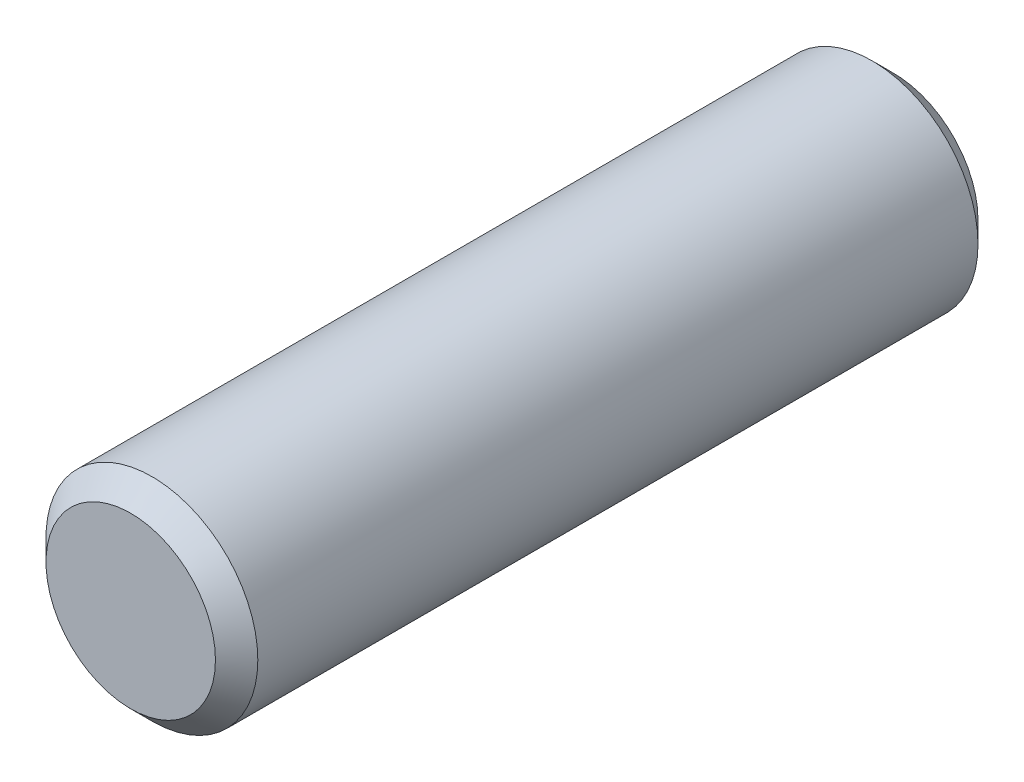
ISO-10303-21;
HEADER;
FILE_DESCRIPTION(('STEP AP214'),'2;1');
FILE_NAME('part.step','',(''),(''),'','','');
FILE_SCHEMA(('AUTOMOTIVE_DESIGN { 1 0 10303 214 1 1 1 1 }'));
ENDSEC;
DATA;
#1=APPLICATION_CONTEXT('core data for automotive mechanical design processes');
#2=APPLICATION_PROTOCOL_DEFINITION('international standard','automotive_design',2000,#1);
#3=PRODUCT_CONTEXT('',#1,'mechanical');
#4=PRODUCT('Part','Part','',(#3));
#5=PRODUCT_RELATED_PRODUCT_CATEGORY('part','',(#4));
#6=PRODUCT_DEFINITION_FORMATION('','',#4);
#7=PRODUCT_DEFINITION_CONTEXT('part definition',#1,'design');
#8=PRODUCT_DEFINITION('design','',#6,#7);
#9=PRODUCT_DEFINITION_SHAPE('','',#8);
#10=(LENGTH_UNIT() NAMED_UNIT(*) SI_UNIT(.MILLI.,.METRE.));
#11=(NAMED_UNIT(*) PLANE_ANGLE_UNIT() SI_UNIT($,.RADIAN.));
#12=(NAMED_UNIT(*) SI_UNIT($,.STERADIAN.) SOLID_ANGLE_UNIT());
#13=UNCERTAINTY_MEASURE_WITH_UNIT(LENGTH_MEASURE(1.E-05),#10,'distance_accuracy_value','');
#14=(GEOMETRIC_REPRESENTATION_CONTEXT(3) GLOBAL_UNCERTAINTY_ASSIGNED_CONTEXT((#13)) GLOBAL_UNIT_ASSIGNED_CONTEXT((#10,
#11,#12)) REPRESENTATION_CONTEXT('',''));
#15=CARTESIAN_POINT('',(0.,0.,0.));
#16=DIRECTION('',(0.,0.,1.));
#17=DIRECTION('',(1.,0.,0.));
#18=AXIS2_PLACEMENT_3D('',#15,#16,#17);
#19=CARTESIAN_POINT('',(0.,0.,36.));
#20=DIRECTION('',(0.,0.,-1.));
#21=DIRECTION('',(-1.,0.,0.));
#22=AXIS2_PLACEMENT_3D('',#19,#20,#21);
#23=CYLINDRICAL_SURFACE('',#22,5.);
#24=CARTESIAN_POINT('',(0.,0.,1.00000000000001));
#25=DIRECTION('',(0.,0.,1.));
#26=DIRECTION('',(1.,0.,0.));
#27=AXIS2_PLACEMENT_3D('',#24,#25,#26);
#28=CIRCLE('',#27,5.);
#29=CARTESIAN_POINT('',(5.,0.,1.00000000000001));
#30=VERTEX_POINT('',#29);
#31=EDGE_CURVE('E50',#30,#30,#28,.T.);
#32=ORIENTED_EDGE('',*,*,#31,.T.);
#33=EDGE_LOOP('',(#32));
#34=FACE_BOUND('',#33,.T.);
#35=CARTESIAN_POINT('',(0.,0.,35.));
#36=DIRECTION('',(0.,0.,1.));
#37=DIRECTION('',(1.,0.,0.));
#38=AXIS2_PLACEMENT_3D('',#35,#36,#37);
#39=CIRCLE('',#38,5.);
#40=CARTESIAN_POINT('',(5.,0.,35.));
#41=VERTEX_POINT('',#40);
#42=EDGE_CURVE('E55',#41,#41,#39,.F.);
#43=ORIENTED_EDGE('',*,*,#42,.T.);
#44=EDGE_LOOP('',(#43));
#45=FACE_BOUND('',#44,.T.);
#46=ADVANCED_FACE('F37',(#34,#45),#23,.T.);
#47=CARTESIAN_POINT('',(0.,0.,36.));
#48=DIRECTION('',(0.,0.,1.));
#49=DIRECTION('',(1.,0.,0.));
#50=AXIS2_PLACEMENT_3D('',#47,#48,#49);
#51=PLANE('',#50);
#52=CARTESIAN_POINT('',(0.,0.,36.));
#53=DIRECTION('',(0.,0.,1.));
#54=DIRECTION('',(1.,0.,0.));
#55=AXIS2_PLACEMENT_3D('',#52,#53,#54);
#56=CIRCLE('',#55,3.99999999999999);
#57=CARTESIAN_POINT('',(3.99999999999999,0.,36.));
#58=VERTEX_POINT('',#57);
#59=EDGE_CURVE('E10',#58,#58,#56,.T.);
#60=ORIENTED_EDGE('',*,*,#59,.T.);
#61=EDGE_LOOP('',(#60));
#62=FACE_BOUND('',#61,.T.);
#63=ADVANCED_FACE('F72',(#62),#51,.T.);
#64=CARTESIAN_POINT('',(0.,0.,0.));
#65=DIRECTION('',(0.,0.,1.));
#66=DIRECTION('',(1.,0.,0.));
#67=AXIS2_PLACEMENT_3D('',#64,#65,#66);
#68=PLANE('',#67);
#69=CARTESIAN_POINT('',(0.,0.,0.));
#70=DIRECTION('',(0.,0.,1.));
#71=DIRECTION('',(1.,0.,0.));
#72=AXIS2_PLACEMENT_3D('',#69,#70,#71);
#73=CIRCLE('',#72,3.99999999999999);
#74=CARTESIAN_POINT('',(3.99999999999999,0.,0.));
#75=VERTEX_POINT('',#74);
#76=EDGE_CURVE('E45',#75,#75,#73,.F.);
#77=ORIENTED_EDGE('',*,*,#76,.T.);
#78=EDGE_LOOP('',(#77));
#79=FACE_BOUND('',#78,.T.);
#80=ADVANCED_FACE('F69',(#79),#68,.F.);
#81=CARTESIAN_POINT('',(0.,0.,1.00000000000001));
#82=DIRECTION('',(0.,0.,1.));
#83=DIRECTION('',(1.,0.,0.));
#84=AXIS2_PLACEMENT_3D('',#81,#82,#83);
#85=CONICAL_SURFACE('',#84,5.,0.785398163397451);
#86=ORIENTED_EDGE('',*,*,#76,.F.);
#87=EDGE_LOOP('',(#86));
#88=FACE_BOUND('',#87,.T.);
#89=ORIENTED_EDGE('',*,*,#31,.F.);
#90=EDGE_LOOP('',(#89));
#91=FACE_BOUND('',#90,.T.);
#92=ADVANCED_FACE('F65',(#88,#91),#85,.T.);
#93=CARTESIAN_POINT('',(0.,0.,36.));
#94=DIRECTION('',(0.,0.,-1.));
#95=DIRECTION('',(-1.,0.,0.));
#96=AXIS2_PLACEMENT_3D('',#93,#94,#95);
#97=CONICAL_SURFACE('',#96,3.99999999999999,0.785398163397448);
#98=ORIENTED_EDGE('',*,*,#42,.F.);
#99=EDGE_LOOP('',(#98));
#100=FACE_BOUND('',#99,.T.);
#101=ORIENTED_EDGE('',*,*,#59,.F.);
#102=EDGE_LOOP('',(#101));
#103=FACE_BOUND('',#102,.T.);
#104=ADVANCED_FACE('F39',(#100,#103),#97,.T.);
#105=CLOSED_SHELL('',(#46,#63,#80,#92,#104));
#106=MANIFOLD_SOLID_BREP('B2',#105);
#107=ADVANCED_BREP_SHAPE_REPRESENTATION('',(#18,#106),#14);
#108=SHAPE_DEFINITION_REPRESENTATION(#9,#107);
ENDSEC;
END-ISO-10303-21;
